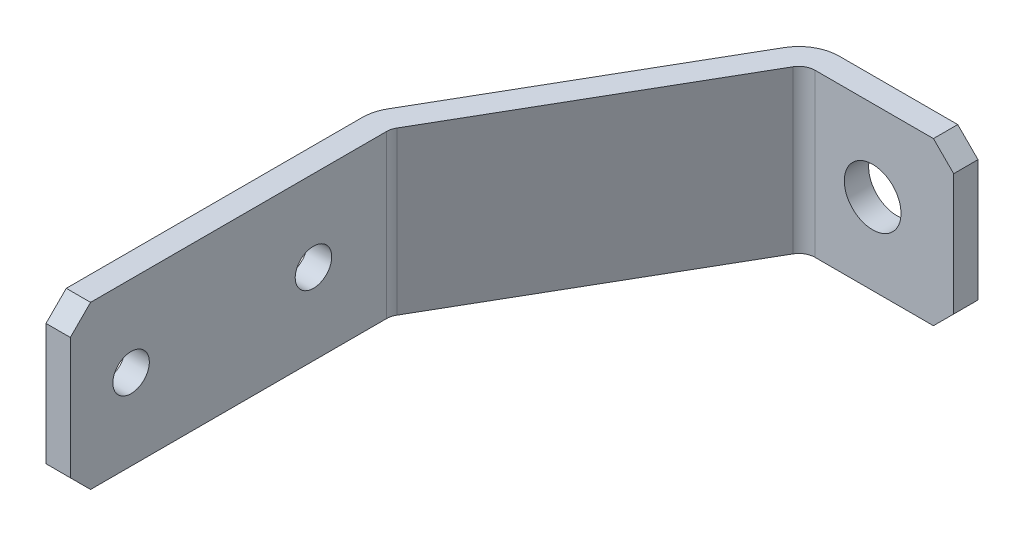
ISO-10303-21;
HEADER;
FILE_DESCRIPTION(('STEP AP214'),'2;1');
FILE_NAME('part.step','',(''),(''),'','','');
FILE_SCHEMA(('AUTOMOTIVE_DESIGN { 1 0 10303 214 1 1 1 1 }'));
ENDSEC;
DATA;
#1=APPLICATION_CONTEXT('core data for automotive mechanical design processes');
#2=APPLICATION_PROTOCOL_DEFINITION('international standard','automotive_design',2000,#1);
#3=PRODUCT_CONTEXT('',#1,'mechanical');
#4=PRODUCT('Part','Part','',(#3));
#5=PRODUCT_RELATED_PRODUCT_CATEGORY('part','',(#4));
#6=PRODUCT_DEFINITION_FORMATION('','',#4);
#7=PRODUCT_DEFINITION_CONTEXT('part definition',#1,'design');
#8=PRODUCT_DEFINITION('design','',#6,#7);
#9=PRODUCT_DEFINITION_SHAPE('','',#8);
#10=(LENGTH_UNIT() NAMED_UNIT(*) SI_UNIT(.MILLI.,.METRE.));
#11=(NAMED_UNIT(*) PLANE_ANGLE_UNIT() SI_UNIT($,.RADIAN.));
#12=(NAMED_UNIT(*) SI_UNIT($,.STERADIAN.) SOLID_ANGLE_UNIT());
#13=UNCERTAINTY_MEASURE_WITH_UNIT(LENGTH_MEASURE(1.E-05),#10,'distance_accuracy_value','');
#14=(GEOMETRIC_REPRESENTATION_CONTEXT(3) GLOBAL_UNCERTAINTY_ASSIGNED_CONTEXT((#13)) GLOBAL_UNIT_ASSIGNED_CONTEXT((#10,
#11,#12)) REPRESENTATION_CONTEXT('',''));
#15=CARTESIAN_POINT('',(0.,0.,0.));
#16=DIRECTION('',(0.,0.,1.));
#17=DIRECTION('',(1.,0.,0.));
#18=AXIS2_PLACEMENT_3D('',#15,#16,#17);
#19=CARTESIAN_POINT('',(60.,0.,5.99999999999997));
#20=DIRECTION('',(0.,0.,-1.));
#21=DIRECTION('',(-1.,0.,0.));
#22=AXIS2_PLACEMENT_3D('',#19,#20,#21);
#23=CYLINDRICAL_SURFACE('',#22,7.);
#24=CARTESIAN_POINT('',(60.,0.,5.99999999999997));
#25=DIRECTION('',(0.,0.,-1.));
#26=DIRECTION('',(-1.,0.,0.));
#27=AXIS2_PLACEMENT_3D('',#24,#25,#26);
#28=CIRCLE('',#27,7.);
#29=CARTESIAN_POINT('',(53.,0.,5.99999999999997));
#30=VERTEX_POINT('',#29);
#31=EDGE_CURVE('E17',#30,#30,#28,.T.);
#32=ORIENTED_EDGE('',*,*,#31,.F.);
#33=EDGE_LOOP('',(#32));
#34=FACE_BOUND('',#33,.T.);
#35=CARTESIAN_POINT('',(60.,0.,0.));
#36=DIRECTION('',(0.,0.,-1.));
#37=DIRECTION('',(-1.,0.,0.));
#38=AXIS2_PLACEMENT_3D('',#35,#36,#37);
#39=CIRCLE('',#38,7.);
#40=CARTESIAN_POINT('',(53.,0.,0.));
#41=VERTEX_POINT('',#40);
#42=EDGE_CURVE('E220',#41,#41,#39,.F.);
#43=ORIENTED_EDGE('',*,*,#42,.F.);
#44=EDGE_LOOP('',(#43));
#45=FACE_BOUND('',#44,.T.);
#46=ADVANCED_FACE('F14',(#34,#45),#23,.F.);
#47=CARTESIAN_POINT('',(79.9999999999998,20.,5.99999999999997));
#48=DIRECTION('',(1.,0.,0.));
#49=DIRECTION('',(0.,0.,-1.));
#50=AXIS2_PLACEMENT_3D('',#47,#48,#49);
#51=PLANE('',#50);
#52=DIRECTION('',(0.,0.,1.));
#53=VECTOR('',#52,1.);
#54=CARTESIAN_POINT('',(79.9999999999998,15.0000000000002,7.50000000000003));
#55=LINE('',#54,#53);
#56=CARTESIAN_POINT('',(79.9999999999998,15.0000000000002,5.99999999999997));
#57=VERTEX_POINT('',#56);
#58=CARTESIAN_POINT('',(79.9999999999998,15.0000000000002,0.));
#59=VERTEX_POINT('',#58);
#60=EDGE_CURVE('E204',#57,#59,#55,.F.);
#61=ORIENTED_EDGE('',*,*,#60,.F.);
#62=DIRECTION('',(0.,1.,0.));
#63=VECTOR('',#62,1.);
#64=CARTESIAN_POINT('',(79.9999999999998,20.,5.99999999999997));
#65=LINE('',#64,#63);
#66=CARTESIAN_POINT('',(79.9999999999998,-15.0000000000002,5.99999999999997));
#67=VERTEX_POINT('',#66);
#68=EDGE_CURVE('E228',#67,#57,#65,.T.);
#69=ORIENTED_EDGE('',*,*,#68,.F.);
#70=DIRECTION('',(0.,0.,1.));
#71=VECTOR('',#70,1.);
#72=CARTESIAN_POINT('',(79.9999999999998,-15.0000000000002,7.50000000000003));
#73=LINE('',#72,#71);
#74=CARTESIAN_POINT('',(79.9999999999998,-15.0000000000002,0.));
#75=VERTEX_POINT('',#74);
#76=EDGE_CURVE('E229',#75,#67,#73,.T.);
#77=ORIENTED_EDGE('',*,*,#76,.F.);
#78=DIRECTION('',(0.,1.,0.));
#79=VECTOR('',#78,1.);
#80=CARTESIAN_POINT('',(79.9999999999998,20.,0.));
#81=LINE('',#80,#79);
#82=EDGE_CURVE('E199',#59,#75,#81,.F.);
#83=ORIENTED_EDGE('',*,*,#82,.F.);
#84=EDGE_LOOP('',(#61,#69,#77,#83));
#85=FACE_BOUND('',#84,.T.);
#86=ADVANCED_FACE('F259',(#85),#51,.T.);
#87=CARTESIAN_POINT('',(80.,-15.,7.50000000000003));
#88=DIRECTION('',(0.70710678118655,-0.707106781186545,0.));
#89=DIRECTION('',(0.707106781186545,0.70710678118655,0.));
#90=AXIS2_PLACEMENT_3D('',#87,#88,#89);
#91=PLANE('',#90);
#92=ORIENTED_EDGE('',*,*,#76,.T.);
#93=DIRECTION('',(0.707106781186545,0.70710678118655,0.));
#94=VECTOR('',#93,1.);
#95=CARTESIAN_POINT('',(75.,-20.,5.99999999999997));
#96=LINE('',#95,#94);
#97=CARTESIAN_POINT('',(75.,-20.,5.99999999999996));
#98=VERTEX_POINT('',#97);
#99=EDGE_CURVE('E79',#98,#67,#96,.T.);
#100=ORIENTED_EDGE('',*,*,#99,.F.);
#101=DIRECTION('',(0.,0.,-1.));
#102=VECTOR('',#101,1.);
#103=CARTESIAN_POINT('',(75.,-20.,60.6731490378061));
#104=LINE('',#103,#102);
#105=CARTESIAN_POINT('',(75.,-20.,0.));
#106=VERTEX_POINT('',#105);
#107=EDGE_CURVE('E180',#106,#98,#104,.F.);
#108=ORIENTED_EDGE('',*,*,#107,.F.);
#109=DIRECTION('',(-0.707106781186545,-0.70710678118655,0.));
#110=VECTOR('',#109,1.);
#111=CARTESIAN_POINT('',(79.9999999999998,-15.0000000000002,0.));
#112=LINE('',#111,#110);
#113=EDGE_CURVE('E200',#75,#106,#112,.T.);
#114=ORIENTED_EDGE('',*,*,#113,.F.);
#115=EDGE_LOOP('',(#92,#100,#108,#114));
#116=FACE_BOUND('',#115,.T.);
#117=ADVANCED_FACE('F265',(#116),#91,.T.);
#118=CARTESIAN_POINT('',(74.9999999999998,20.,5.99999999999997));
#119=DIRECTION('',(0.,0.,1.));
#120=DIRECTION('',(1.,0.,0.));
#121=AXIS2_PLACEMENT_3D('',#118,#119,#120);
#122=PLANE('',#121);
#123=ORIENTED_EDGE('',*,*,#31,.T.);
#124=EDGE_LOOP('',(#123));
#125=FACE_BOUND('',#124,.T.);
#126=DIRECTION('',(0.,-1.,0.));
#127=VECTOR('',#126,1.);
#128=CARTESIAN_POINT('',(45.7735026918961,20.,5.99999999999997));
#129=LINE('',#128,#127);
#130=CARTESIAN_POINT('',(45.7735026918961,20.,5.99999999999997));
#131=VERTEX_POINT('',#130);
#132=CARTESIAN_POINT('',(45.7735026918961,-20.,5.99999999999997));
#133=VERTEX_POINT('',#132);
#134=EDGE_CURVE('E69',#131,#133,#129,.T.);
#135=ORIENTED_EDGE('',*,*,#134,.T.);
#136=DIRECTION('',(1.,0.,0.));
#137=VECTOR('',#136,1.);
#138=CARTESIAN_POINT('',(22.4668681968243,-20.,5.99999999999996));
#139=LINE('',#138,#137);
#140=EDGE_CURVE('E177',#98,#133,#139,.F.);
#141=ORIENTED_EDGE('',*,*,#140,.F.);
#142=ORIENTED_EDGE('',*,*,#99,.T.);
#143=ORIENTED_EDGE('',*,*,#68,.T.);
#144=DIRECTION('',(-0.707106781186545,0.70710678118655,0.));
#145=VECTOR('',#144,1.);
#146=CARTESIAN_POINT('',(80.,15.,5.99999999999997));
#147=LINE('',#146,#145);
#148=CARTESIAN_POINT('',(75.,20.,5.99999999999996));
#149=VERTEX_POINT('',#148);
#150=EDGE_CURVE('E217',#149,#57,#147,.F.);
#151=ORIENTED_EDGE('',*,*,#150,.F.);
#152=DIRECTION('',(1.,0.,0.));
#153=VECTOR('',#152,1.);
#154=CARTESIAN_POINT('',(22.4668681968243,20.,5.99999999999996));
#155=LINE('',#154,#153);
#156=EDGE_CURVE('E142',#149,#131,#155,.F.);
#157=ORIENTED_EDGE('',*,*,#156,.T.);
#158=EDGE_LOOP('',(#135,#141,#142,#143,#151,#157));
#159=FACE_BOUND('',#158,.T.);
#160=ADVANCED_FACE('F330',(#125,#159),#122,.T.);
#161=CARTESIAN_POINT('',(45.7735026918961,20.,9.99999999999998));
#162=DIRECTION('',(0.,-1.,0.));
#163=DIRECTION('',(0.,0.,-1.));
#164=AXIS2_PLACEMENT_3D('',#161,#162,#163);
#165=CYLINDRICAL_SURFACE('',#164,4.00000000000001);
#166=ORIENTED_EDGE('',*,*,#134,.F.);
#167=CARTESIAN_POINT('',(45.7735026918961,20.,9.99999999999998));
#168=DIRECTION('',(0.,-1.,0.));
#169=DIRECTION('',(0.,0.,-1.));
#170=AXIS2_PLACEMENT_3D('',#167,#168,#169);
#171=CIRCLE('',#170,4.00000000000001);
#172=CARTESIAN_POINT('',(42.3094010767584,20.,7.99999999999998));
#173=VERTEX_POINT('',#172);
#174=EDGE_CURVE('E141',#131,#173,#171,.F.);
#175=ORIENTED_EDGE('',*,*,#174,.T.);
#176=DIRECTION('',(0.,1.,0.));
#177=VECTOR('',#176,1.);
#178=CARTESIAN_POINT('',(42.3094010767584,20.,7.99999999999999));
#179=LINE('',#178,#177);
#180=CARTESIAN_POINT('',(42.3094010767584,-20.,7.99999999999998));
#181=VERTEX_POINT('',#180);
#182=EDGE_CURVE('E125',#181,#173,#179,.T.);
#183=ORIENTED_EDGE('',*,*,#182,.F.);
#184=CARTESIAN_POINT('',(45.7735026918961,-20.,9.99999999999998));
#185=DIRECTION('',(0.,-1.,0.));
#186=DIRECTION('',(0.,0.,-1.));
#187=AXIS2_PLACEMENT_3D('',#184,#185,#186);
#188=CIRCLE('',#187,4.00000000000001);
#189=EDGE_CURVE('E176',#133,#181,#188,.F.);
#190=ORIENTED_EDGE('',*,*,#189,.F.);
#191=EDGE_LOOP('',(#166,#175,#183,#190));
#192=FACE_BOUND('',#191,.T.);
#193=ADVANCED_FACE('F326',(#192),#165,.F.);
#194=CARTESIAN_POINT('',(6.53589838486217,20.,69.9615242270663));
#195=DIRECTION('',(0.866025403784439,0.,0.5));
#196=DIRECTION('',(0.5,0.,-0.866025403784439));
#197=AXIS2_PLACEMENT_3D('',#194,#195,#196);
#198=PLANE('',#197);
#199=DIRECTION('',(-0.499999999999999,0.,0.866025403784439));
#200=VECTOR('',#199,1.);
#201=CARTESIAN_POINT('',(42.3094010767584,20.,7.99999999999999));
#202=LINE('',#201,#200);
#203=CARTESIAN_POINT('',(6.53589838486216,20.,69.9615242270663));
#204=VERTEX_POINT('',#203);
#205=EDGE_CURVE('E138',#173,#204,#202,.T.);
#206=ORIENTED_EDGE('',*,*,#205,.T.);
#207=DIRECTION('',(0.,-1.,0.));
#208=VECTOR('',#207,1.);
#209=CARTESIAN_POINT('',(6.53589838486217,20.,69.9615242270663));
#210=LINE('',#209,#208);
#211=CARTESIAN_POINT('',(6.53589838486217,-20.,69.9615242270663));
#212=VERTEX_POINT('',#211);
#213=EDGE_CURVE('E165',#204,#212,#210,.T.);
#214=ORIENTED_EDGE('',*,*,#213,.T.);
#215=DIRECTION('',(-0.499999999999999,0.,0.866025403784439));
#216=VECTOR('',#215,1.);
#217=CARTESIAN_POINT('',(42.3094010767584,-20.,7.99999999999999));
#218=LINE('',#217,#216);
#219=EDGE_CURVE('E173',#181,#212,#218,.T.);
#220=ORIENTED_EDGE('',*,*,#219,.F.);
#221=ORIENTED_EDGE('',*,*,#182,.T.);
#222=EDGE_LOOP('',(#206,#214,#220,#221));
#223=FACE_BOUND('',#222,.T.);
#224=ADVANCED_FACE('F323',(#223),#198,.T.);
#225=CARTESIAN_POINT('',(10.0000000000001,20.,71.9615242270664));
#226=DIRECTION('',(0.,-1.,0.));
#227=DIRECTION('',(0.,0.,-1.));
#228=AXIS2_PLACEMENT_3D('',#225,#226,#227);
#229=CYLINDRICAL_SURFACE('',#228,10.0000000000001);
#230=CARTESIAN_POINT('',(10.0000000000001,20.,71.9615242270664));
#231=DIRECTION('',(0.,-1.,0.));
#232=DIRECTION('',(0.,0.,-1.));
#233=AXIS2_PLACEMENT_3D('',#230,#231,#232);
#234=CIRCLE('',#233,10.0000000000001);
#235=CARTESIAN_POINT('',(0.,20.,71.9615242270664));
#236=VERTEX_POINT('',#235);
#237=CARTESIAN_POINT('',(1.33974596215565,20.,66.9615242270664));
#238=VERTEX_POINT('',#237);
#239=EDGE_CURVE('E104',#236,#238,#234,.T.);
#240=ORIENTED_EDGE('',*,*,#239,.T.);
#241=DIRECTION('',(0.,1.,0.));
#242=VECTOR('',#241,1.);
#243=CARTESIAN_POINT('',(1.33974596215566,20.,66.9615242270664));
#244=LINE('',#243,#242);
#245=CARTESIAN_POINT('',(1.33974596215565,-20.,66.9615242270664));
#246=VERTEX_POINT('',#245);
#247=EDGE_CURVE('E108',#246,#238,#244,.T.);
#248=ORIENTED_EDGE('',*,*,#247,.F.);
#249=CARTESIAN_POINT('',(10.0000000000001,-20.,71.9615242270664));
#250=DIRECTION('',(0.,-1.,0.));
#251=DIRECTION('',(0.,0.,-1.));
#252=AXIS2_PLACEMENT_3D('',#249,#250,#251);
#253=CIRCLE('',#252,10.0000000000001);
#254=CARTESIAN_POINT('',(0.,-20.,71.9615242270664));
#255=VERTEX_POINT('',#254);
#256=EDGE_CURVE('E168',#255,#246,#253,.T.);
#257=ORIENTED_EDGE('',*,*,#256,.F.);
#258=DIRECTION('',(0.,1.,0.));
#259=VECTOR('',#258,1.);
#260=CARTESIAN_POINT('',(0.,20.,71.9615242270664));
#261=LINE('',#260,#259);
#262=EDGE_CURVE('E110',#236,#255,#261,.F.);
#263=ORIENTED_EDGE('',*,*,#262,.F.);
#264=EDGE_LOOP('',(#240,#248,#257,#263));
#265=FACE_BOUND('',#264,.T.);
#266=ADVANCED_FACE('F106',(#265),#229,.T.);
#267=CARTESIAN_POINT('',(37.1132486540519,20.,5.00000000000001));
#268=DIRECTION('',(-0.866025403784439,0.,-0.499999999999999));
#269=DIRECTION('',(-0.499999999999999,0.,0.866025403784439));
#270=AXIS2_PLACEMENT_3D('',#267,#268,#269);
#271=PLANE('',#270);
#272=DIRECTION('',(0.499999999999999,0.,-0.866025403784439));
#273=VECTOR('',#272,1.);
#274=CARTESIAN_POINT('',(1.33974596215565,20.,66.9615242270664));
#275=LINE('',#274,#273);
#276=CARTESIAN_POINT('',(37.1132486540518,20.,5.00000000000001));
#277=VERTEX_POINT('',#276);
#278=EDGE_CURVE('E115',#238,#277,#275,.T.);
#279=ORIENTED_EDGE('',*,*,#278,.T.);
#280=DIRECTION('',(0.,-1.,0.));
#281=VECTOR('',#280,1.);
#282=CARTESIAN_POINT('',(37.1132486540518,20.,4.99999999999994));
#283=LINE('',#282,#281);
#284=CARTESIAN_POINT('',(37.1132486540518,-20.,5.00000000000001));
#285=VERTEX_POINT('',#284);
#286=EDGE_CURVE('E124',#285,#277,#283,.F.);
#287=ORIENTED_EDGE('',*,*,#286,.F.);
#288=DIRECTION('',(0.499999999999999,0.,-0.866025403784439));
#289=VECTOR('',#288,1.);
#290=CARTESIAN_POINT('',(1.33974596215565,-20.,66.9615242270664));
#291=LINE('',#290,#289);
#292=EDGE_CURVE('E122',#246,#285,#291,.T.);
#293=ORIENTED_EDGE('',*,*,#292,.F.);
#294=ORIENTED_EDGE('',*,*,#247,.T.);
#295=EDGE_LOOP('',(#279,#287,#293,#294));
#296=FACE_BOUND('',#295,.T.);
#297=ADVANCED_FACE('F119',(#296),#271,.T.);
#298=CARTESIAN_POINT('',(45.7735026918961,20.,9.99999999999999));
#299=DIRECTION('',(0.,-1.,0.));
#300=DIRECTION('',(0.,0.,-1.));
#301=AXIS2_PLACEMENT_3D('',#298,#299,#300);
#302=CYLINDRICAL_SURFACE('',#301,9.99999999999999);
#303=CARTESIAN_POINT('',(45.7735026918961,20.,9.99999999999999));
#304=DIRECTION('',(0.,-1.,0.));
#305=DIRECTION('',(0.,0.,-1.));
#306=AXIS2_PLACEMENT_3D('',#303,#304,#305);
#307=CIRCLE('',#306,9.99999999999999);
#308=CARTESIAN_POINT('',(45.7735026918961,20.,0.));
#309=VERTEX_POINT('',#308);
#310=EDGE_CURVE('E130',#277,#309,#307,.T.);
#311=ORIENTED_EDGE('',*,*,#310,.T.);
#312=DIRECTION('',(0.,1.,0.));
#313=VECTOR('',#312,1.);
#314=CARTESIAN_POINT('',(45.7735026918961,20.,0.));
#315=LINE('',#314,#313);
#316=CARTESIAN_POINT('',(45.7735026918961,-20.,0.));
#317=VERTEX_POINT('',#316);
#318=EDGE_CURVE('E196',#317,#309,#315,.T.);
#319=ORIENTED_EDGE('',*,*,#318,.F.);
#320=CARTESIAN_POINT('',(45.7735026918961,-20.,9.99999999999999));
#321=DIRECTION('',(0.,-1.,0.));
#322=DIRECTION('',(0.,0.,-1.));
#323=AXIS2_PLACEMENT_3D('',#320,#321,#322);
#324=CIRCLE('',#323,9.99999999999999);
#325=EDGE_CURVE('E166',#285,#317,#324,.T.);
#326=ORIENTED_EDGE('',*,*,#325,.F.);
#327=ORIENTED_EDGE('',*,*,#286,.T.);
#328=EDGE_LOOP('',(#311,#319,#326,#327));
#329=FACE_BOUND('',#328,.T.);
#330=ADVANCED_FACE('F315',(#329),#302,.T.);
#331=CARTESIAN_POINT('',(74.9999999999998,20.,0.));
#332=DIRECTION('',(0.,0.,-1.));
#333=DIRECTION('',(-1.,0.,0.));
#334=AXIS2_PLACEMENT_3D('',#331,#332,#333);
#335=PLANE('',#334);
#336=ORIENTED_EDGE('',*,*,#42,.T.);
#337=EDGE_LOOP('',(#336));
#338=FACE_BOUND('',#337,.T.);
#339=DIRECTION('',(-0.707106781186545,0.70710678118655,0.));
#340=VECTOR('',#339,1.);
#341=CARTESIAN_POINT('',(80.,15.,0.));
#342=LINE('',#341,#340);
#343=CARTESIAN_POINT('',(75.,20.,0.));
#344=VERTEX_POINT('',#343);
#345=EDGE_CURVE('E201',#59,#344,#342,.T.);
#346=ORIENTED_EDGE('',*,*,#345,.F.);
#347=ORIENTED_EDGE('',*,*,#82,.T.);
#348=ORIENTED_EDGE('',*,*,#113,.T.);
#349=DIRECTION('',(1.,0.,0.));
#350=VECTOR('',#349,1.);
#351=CARTESIAN_POINT('',(22.4668681968243,-20.,0.));
#352=LINE('',#351,#350);
#353=EDGE_CURVE('E162',#317,#106,#352,.T.);
#354=ORIENTED_EDGE('',*,*,#353,.F.);
#355=ORIENTED_EDGE('',*,*,#318,.T.);
#356=DIRECTION('',(1.,0.,0.));
#357=VECTOR('',#356,1.);
#358=CARTESIAN_POINT('',(22.4668681968243,20.,0.));
#359=LINE('',#358,#357);
#360=EDGE_CURVE('E132',#309,#344,#359,.T.);
#361=ORIENTED_EDGE('',*,*,#360,.T.);
#362=EDGE_LOOP('',(#346,#347,#348,#354,#355,#361));
#363=FACE_BOUND('',#362,.T.);
#364=ADVANCED_FACE('F255',(#338,#363),#335,.T.);
#365=CARTESIAN_POINT('',(80.,15.,7.50000000000003));
#366=DIRECTION('',(0.70710678118655,0.707106781186545,0.));
#367=DIRECTION('',(-0.707106781186545,0.70710678118655,0.));
#368=AXIS2_PLACEMENT_3D('',#365,#366,#367);
#369=PLANE('',#368);
#370=ORIENTED_EDGE('',*,*,#60,.T.);
#371=ORIENTED_EDGE('',*,*,#345,.T.);
#372=DIRECTION('',(0.,0.,-1.));
#373=VECTOR('',#372,1.);
#374=CARTESIAN_POINT('',(75.,20.,60.6731490378061));
#375=LINE('',#374,#373);
#376=EDGE_CURVE('E205',#344,#149,#375,.F.);
#377=ORIENTED_EDGE('',*,*,#376,.T.);
#378=ORIENTED_EDGE('',*,*,#150,.T.);
#379=EDGE_LOOP('',(#370,#371,#377,#378));
#380=FACE_BOUND('',#379,.T.);
#381=ADVANCED_FACE('F308',(#380),#369,.T.);
#382=CARTESIAN_POINT('',(0.,20.,145.));
#383=DIRECTION('',(-1.,0.,0.));
#384=DIRECTION('',(0.,0.,1.));
#385=AXIS2_PLACEMENT_3D('',#382,#383,#384);
#386=PLANE('',#385);
#387=CARTESIAN_POINT('',(0.,0.,90.));
#388=DIRECTION('',(-1.,0.,0.));
#389=DIRECTION('',(0.,-1.,0.));
#390=AXIS2_PLACEMENT_3D('',#387,#388,#389);
#391=CIRCLE('',#390,4.5);
#392=CARTESIAN_POINT('',(0.,-4.5,90.));
#393=VERTEX_POINT('',#392);
#394=EDGE_CURVE('E158',#393,#393,#391,.F.);
#395=ORIENTED_EDGE('',*,*,#394,.T.);
#396=EDGE_LOOP('',(#395));
#397=FACE_BOUND('',#396,.T.);
#398=CARTESIAN_POINT('',(0.,0.,135.));
#399=DIRECTION('',(-1.,0.,0.));
#400=DIRECTION('',(0.,-1.,0.));
#401=AXIS2_PLACEMENT_3D('',#398,#399,#400);
#402=CIRCLE('',#401,4.5);
#403=CARTESIAN_POINT('',(0.,-4.49999999999999,135.));
#404=VERTEX_POINT('',#403);
#405=EDGE_CURVE('E208',#404,#404,#402,.F.);
#406=ORIENTED_EDGE('',*,*,#405,.T.);
#407=EDGE_LOOP('',(#406));
#408=FACE_BOUND('',#407,.T.);
#409=DIRECTION('',(0.,-0.70710678118655,-0.707106781186545));
#410=VECTOR('',#409,1.);
#411=CARTESIAN_POINT('',(0.,-15.,150.));
#412=LINE('',#411,#410);
#413=CARTESIAN_POINT('',(0.,-15.,150.));
#414=VERTEX_POINT('',#413);
#415=CARTESIAN_POINT('',(0.,-20.,145.));
#416=VERTEX_POINT('',#415);
#417=EDGE_CURVE('E188',#414,#416,#412,.T.);
#418=ORIENTED_EDGE('',*,*,#417,.F.);
#419=DIRECTION('',(0.,1.,0.));
#420=VECTOR('',#419,1.);
#421=CARTESIAN_POINT('',(0.,20.,150.));
#422=LINE('',#421,#420);
#423=CARTESIAN_POINT('',(0.,15.,150.));
#424=VERTEX_POINT('',#423);
#425=EDGE_CURVE('E189',#424,#414,#422,.F.);
#426=ORIENTED_EDGE('',*,*,#425,.F.);
#427=DIRECTION('',(0.,-0.70710678118655,0.707106781186545));
#428=VECTOR('',#427,1.);
#429=CARTESIAN_POINT('',(0.,15.,150.));
#430=LINE('',#429,#428);
#431=CARTESIAN_POINT('',(0.,20.,145.));
#432=VERTEX_POINT('',#431);
#433=EDGE_CURVE('E195',#432,#424,#430,.T.);
#434=ORIENTED_EDGE('',*,*,#433,.F.);
#435=DIRECTION('',(0.,0.,-1.));
#436=VECTOR('',#435,1.);
#437=CARTESIAN_POINT('',(0.,20.,60.6731490378061));
#438=LINE('',#437,#436);
#439=EDGE_CURVE('E116',#432,#236,#438,.T.);
#440=ORIENTED_EDGE('',*,*,#439,.T.);
#441=ORIENTED_EDGE('',*,*,#262,.T.);
#442=DIRECTION('',(0.,0.,-1.));
#443=VECTOR('',#442,1.);
#444=CARTESIAN_POINT('',(0.,-20.,60.6731490378061));
#445=LINE('',#444,#443);
#446=EDGE_CURVE('E169',#416,#255,#445,.T.);
#447=ORIENTED_EDGE('',*,*,#446,.F.);
#448=EDGE_LOOP('',(#418,#426,#434,#440,#441,#447));
#449=FACE_BOUND('',#448,.T.);
#450=ADVANCED_FACE('F304',(#397,#408,#449),#386,.T.);
#451=CARTESIAN_POINT('',(7.5,15.,150.));
#452=DIRECTION('',(0.,0.707106781186545,0.70710678118655));
#453=DIRECTION('',(0.,-0.70710678118655,0.707106781186545));
#454=AXIS2_PLACEMENT_3D('',#451,#452,#453);
#455=PLANE('',#454);
#456=DIRECTION('',(1.,0.,0.));
#457=VECTOR('',#456,1.);
#458=CARTESIAN_POINT('',(0.,15.,150.));
#459=LINE('',#458,#457);
#460=CARTESIAN_POINT('',(5.99999999999992,15.,150.));
#461=VERTEX_POINT('',#460);
#462=EDGE_CURVE('E192',#461,#424,#459,.F.);
#463=ORIENTED_EDGE('',*,*,#462,.F.);
#464=DIRECTION('',(0.,-0.707106781186552,0.707106781186543));
#465=VECTOR('',#464,1.);
#466=CARTESIAN_POINT('',(5.99999999999992,20.,145.));
#467=LINE('',#466,#465);
#468=CARTESIAN_POINT('',(5.99999999999992,20.,145.));
#469=VERTEX_POINT('',#468);
#470=EDGE_CURVE('E154',#469,#461,#467,.T.);
#471=ORIENTED_EDGE('',*,*,#470,.F.);
#472=DIRECTION('',(1.,0.,0.));
#473=VECTOR('',#472,1.);
#474=CARTESIAN_POINT('',(22.4668681968243,20.,145.));
#475=LINE('',#474,#473);
#476=EDGE_CURVE('E137',#469,#432,#475,.F.);
#477=ORIENTED_EDGE('',*,*,#476,.T.);
#478=ORIENTED_EDGE('',*,*,#433,.T.);
#479=EDGE_LOOP('',(#463,#471,#477,#478));
#480=FACE_BOUND('',#479,.T.);
#481=ADVANCED_FACE('F300',(#480),#455,.T.);
#482=CARTESIAN_POINT('',(0.,20.,150.));
#483=DIRECTION('',(0.,0.,1.));
#484=DIRECTION('',(1.,0.,0.));
#485=AXIS2_PLACEMENT_3D('',#482,#483,#484);
#486=PLANE('',#485);
#487=DIRECTION('',(1.,0.,0.));
#488=VECTOR('',#487,1.);
#489=CARTESIAN_POINT('',(7.5,-15.,150.));
#490=LINE('',#489,#488);
#491=CARTESIAN_POINT('',(5.99999999999992,-15.,150.));
#492=VERTEX_POINT('',#491);
#493=EDGE_CURVE('E185',#492,#414,#490,.F.);
#494=ORIENTED_EDGE('',*,*,#493,.F.);
#495=DIRECTION('',(0.,1.,0.));
#496=VECTOR('',#495,1.);
#497=CARTESIAN_POINT('',(5.99999999999992,20.,150.));
#498=LINE('',#497,#496);
#499=EDGE_CURVE('E157',#461,#492,#498,.F.);
#500=ORIENTED_EDGE('',*,*,#499,.F.);
#501=ORIENTED_EDGE('',*,*,#462,.T.);
#502=ORIENTED_EDGE('',*,*,#425,.T.);
#503=EDGE_LOOP('',(#494,#500,#501,#502));
#504=FACE_BOUND('',#503,.T.);
#505=ADVANCED_FACE('F296',(#504),#486,.T.);
#506=CARTESIAN_POINT('',(7.5,-15.,150.));
#507=DIRECTION('',(0.,-0.707106781186545,0.70710678118655));
#508=DIRECTION('',(0.,-0.70710678118655,-0.707106781186545));
#509=AXIS2_PLACEMENT_3D('',#506,#507,#508);
#510=PLANE('',#509);
#511=DIRECTION('',(1.,0.,0.));
#512=VECTOR('',#511,1.);
#513=CARTESIAN_POINT('',(22.4668681968243,-20.,145.));
#514=LINE('',#513,#512);
#515=CARTESIAN_POINT('',(5.99999999999992,-20.,145.));
#516=VERTEX_POINT('',#515);
#517=EDGE_CURVE('E172',#516,#416,#514,.F.);
#518=ORIENTED_EDGE('',*,*,#517,.F.);
#519=DIRECTION('',(0.,-0.70710678118655,-0.707106781186545));
#520=VECTOR('',#519,1.);
#521=CARTESIAN_POINT('',(5.99999999999992,-15.,150.));
#522=LINE('',#521,#520);
#523=EDGE_CURVE('E161',#492,#516,#522,.T.);
#524=ORIENTED_EDGE('',*,*,#523,.F.);
#525=ORIENTED_EDGE('',*,*,#493,.T.);
#526=ORIENTED_EDGE('',*,*,#417,.T.);
#527=EDGE_LOOP('',(#518,#524,#525,#526));
#528=FACE_BOUND('',#527,.T.);
#529=ADVANCED_FACE('F292',(#528),#510,.T.);
#530=CARTESIAN_POINT('',(22.4668681968243,-20.,60.6731490378061));
#531=DIRECTION('',(0.,-1.,0.));
#532=DIRECTION('',(0.,0.,-1.));
#533=AXIS2_PLACEMENT_3D('',#530,#531,#532);
#534=PLANE('',#533);
#535=ORIENTED_EDGE('',*,*,#325,.T.);
#536=ORIENTED_EDGE('',*,*,#353,.T.);
#537=ORIENTED_EDGE('',*,*,#107,.T.);
#538=ORIENTED_EDGE('',*,*,#140,.T.);
#539=ORIENTED_EDGE('',*,*,#189,.T.);
#540=ORIENTED_EDGE('',*,*,#219,.T.);
#541=CARTESIAN_POINT('',(9.99999999999995,-20.,71.9615242270663));
#542=DIRECTION('',(0.,-1.,0.));
#543=DIRECTION('',(0.,0.,-1.));
#544=AXIS2_PLACEMENT_3D('',#541,#542,#543);
#545=CIRCLE('',#544,4.00000000000003);
#546=CARTESIAN_POINT('',(5.99999999999992,-20.,71.9615242270663));
#547=VERTEX_POINT('',#546);
#548=EDGE_CURVE('E144',#212,#547,#545,.F.);
#549=ORIENTED_EDGE('',*,*,#548,.T.);
#550=DIRECTION('',(0.,0.,-1.));
#551=VECTOR('',#550,1.);
#552=CARTESIAN_POINT('',(5.99999999999992,-20.,145.));
#553=LINE('',#552,#551);
#554=EDGE_CURVE('E149',#516,#547,#553,.T.);
#555=ORIENTED_EDGE('',*,*,#554,.F.);
#556=ORIENTED_EDGE('',*,*,#517,.T.);
#557=ORIENTED_EDGE('',*,*,#446,.T.);
#558=ORIENTED_EDGE('',*,*,#256,.T.);
#559=ORIENTED_EDGE('',*,*,#292,.T.);
#560=EDGE_LOOP('',(#535,#536,#537,#538,#539,#540,#549,#555,#556,#557,#558,#559));
#561=FACE_BOUND('',#560,.T.);
#562=ADVANCED_FACE('F289',(#561),#534,.T.);
#563=CARTESIAN_POINT('',(9.99999999999995,20.,71.9615242270663));
#564=DIRECTION('',(0.,-1.,0.));
#565=DIRECTION('',(0.,0.,-1.));
#566=AXIS2_PLACEMENT_3D('',#563,#564,#565);
#567=CYLINDRICAL_SURFACE('',#566,4.00000000000003);
#568=ORIENTED_EDGE('',*,*,#213,.F.);
#569=CARTESIAN_POINT('',(9.99999999999995,20.,71.9615242270663));
#570=DIRECTION('',(0.,-1.,0.));
#571=DIRECTION('',(0.,0.,-1.));
#572=AXIS2_PLACEMENT_3D('',#569,#570,#571);
#573=CIRCLE('',#572,4.00000000000003);
#574=CARTESIAN_POINT('',(5.99999999999992,20.,71.9615242270663));
#575=VERTEX_POINT('',#574);
#576=EDGE_CURVE('E32',#204,#575,#573,.F.);
#577=ORIENTED_EDGE('',*,*,#576,.T.);
#578=DIRECTION('',(0.,1.,0.));
#579=VECTOR('',#578,1.);
#580=CARTESIAN_POINT('',(5.99999999999992,20.,71.9615242270663));
#581=LINE('',#580,#579);
#582=EDGE_CURVE('E145',#547,#575,#581,.T.);
#583=ORIENTED_EDGE('',*,*,#582,.F.);
#584=ORIENTED_EDGE('',*,*,#548,.F.);
#585=EDGE_LOOP('',(#568,#577,#583,#584));
#586=FACE_BOUND('',#585,.T.);
#587=ADVANCED_FACE('F286',(#586),#567,.F.);
#588=CARTESIAN_POINT('',(22.4668681968243,20.,60.6731490378061));
#589=DIRECTION('',(0.,-1.,0.));
#590=DIRECTION('',(0.,0.,-1.));
#591=AXIS2_PLACEMENT_3D('',#588,#589,#590);
#592=PLANE('',#591);
#593=ORIENTED_EDGE('',*,*,#360,.F.);
#594=ORIENTED_EDGE('',*,*,#310,.F.);
#595=ORIENTED_EDGE('',*,*,#278,.F.);
#596=ORIENTED_EDGE('',*,*,#239,.F.);
#597=ORIENTED_EDGE('',*,*,#439,.F.);
#598=ORIENTED_EDGE('',*,*,#476,.F.);
#599=DIRECTION('',(0.,0.,-1.));
#600=VECTOR('',#599,1.);
#601=CARTESIAN_POINT('',(5.99999999999992,20.,145.));
#602=LINE('',#601,#600);
#603=EDGE_CURVE('E148',#575,#469,#602,.F.);
#604=ORIENTED_EDGE('',*,*,#603,.F.);
#605=ORIENTED_EDGE('',*,*,#576,.F.);
#606=ORIENTED_EDGE('',*,*,#205,.F.);
#607=ORIENTED_EDGE('',*,*,#174,.F.);
#608=ORIENTED_EDGE('',*,*,#156,.F.);
#609=ORIENTED_EDGE('',*,*,#376,.F.);
#610=EDGE_LOOP('',(#593,#594,#595,#596,#597,#598,#604,#605,#606,#607,#608,#609));
#611=FACE_BOUND('',#610,.T.);
#612=ADVANCED_FACE('F129',(#611),#592,.F.);
#613=CARTESIAN_POINT('',(3.,0.,135.));
#614=DIRECTION('',(-1.,0.,0.));
#615=DIRECTION('',(0.,-1.,0.));
#616=AXIS2_PLACEMENT_3D('',#613,#614,#615);
#617=CYLINDRICAL_SURFACE('',#616,4.5);
#618=CARTESIAN_POINT('',(6.,0.,135.));
#619=DIRECTION('',(-1.,0.,0.));
#620=DIRECTION('',(0.,-1.,0.));
#621=AXIS2_PLACEMENT_3D('',#618,#619,#620);
#622=CIRCLE('',#621,4.5);
#623=CARTESIAN_POINT('',(6.,-4.49999999999999,135.));
#624=VERTEX_POINT('',#623);
#625=EDGE_CURVE('E23',#624,#624,#622,.T.);
#626=ORIENTED_EDGE('',*,*,#625,.F.);
#627=EDGE_LOOP('',(#626));
#628=FACE_BOUND('',#627,.T.);
#629=ORIENTED_EDGE('',*,*,#405,.F.);
#630=EDGE_LOOP('',(#629));
#631=FACE_BOUND('',#630,.T.);
#632=ADVANCED_FACE('F276',(#628,#631),#617,.F.);
#633=CARTESIAN_POINT('',(3.,0.,90.));
#634=DIRECTION('',(-1.,0.,0.));
#635=DIRECTION('',(0.,-1.,0.));
#636=AXIS2_PLACEMENT_3D('',#633,#634,#635);
#637=CYLINDRICAL_SURFACE('',#636,4.5);
#638=CARTESIAN_POINT('',(6.,0.,90.));
#639=DIRECTION('',(-1.,0.,0.));
#640=DIRECTION('',(0.,-1.,0.));
#641=AXIS2_PLACEMENT_3D('',#638,#639,#640);
#642=CIRCLE('',#641,4.5);
#643=CARTESIAN_POINT('',(6.,-4.5,90.));
#644=VERTEX_POINT('',#643);
#645=EDGE_CURVE('E9',#644,#644,#642,.T.);
#646=ORIENTED_EDGE('',*,*,#645,.F.);
#647=EDGE_LOOP('',(#646));
#648=FACE_BOUND('',#647,.T.);
#649=ORIENTED_EDGE('',*,*,#394,.F.);
#650=EDGE_LOOP('',(#649));
#651=FACE_BOUND('',#650,.T.);
#652=ADVANCED_FACE('F270',(#648,#651),#637,.F.);
#653=CARTESIAN_POINT('',(5.99999999999992,20.,145.));
#654=DIRECTION('',(1.,0.,0.));
#655=DIRECTION('',(0.,0.,-1.));
#656=AXIS2_PLACEMENT_3D('',#653,#654,#655);
#657=PLANE('',#656);
#658=ORIENTED_EDGE('',*,*,#645,.T.);
#659=EDGE_LOOP('',(#658));
#660=FACE_BOUND('',#659,.T.);
#661=ORIENTED_EDGE('',*,*,#625,.T.);
#662=EDGE_LOOP('',(#661));
#663=FACE_BOUND('',#662,.T.);
#664=ORIENTED_EDGE('',*,*,#582,.T.);
#665=ORIENTED_EDGE('',*,*,#603,.T.);
#666=ORIENTED_EDGE('',*,*,#470,.T.);
#667=ORIENTED_EDGE('',*,*,#499,.T.);
#668=ORIENTED_EDGE('',*,*,#523,.T.);
#669=ORIENTED_EDGE('',*,*,#554,.T.);
#670=EDGE_LOOP('',(#664,#665,#666,#667,#668,#669));
#671=FACE_BOUND('',#670,.T.);
#672=ADVANCED_FACE('F268',(#660,#663,#671),#657,.T.);
#673=CLOSED_SHELL('',(#46,#86,#117,#160,#193,#224,#266,#297,#330,#364,#381,#450,#481,#505,#529,
#562,#587,#612,#632,#652,#672));
#674=MANIFOLD_SOLID_BREP('B1',#673);
#675=ADVANCED_BREP_SHAPE_REPRESENTATION('',(#18,#674),#14);
#676=SHAPE_DEFINITION_REPRESENTATION(#9,#675);
ENDSEC;
END-ISO-10303-21;
